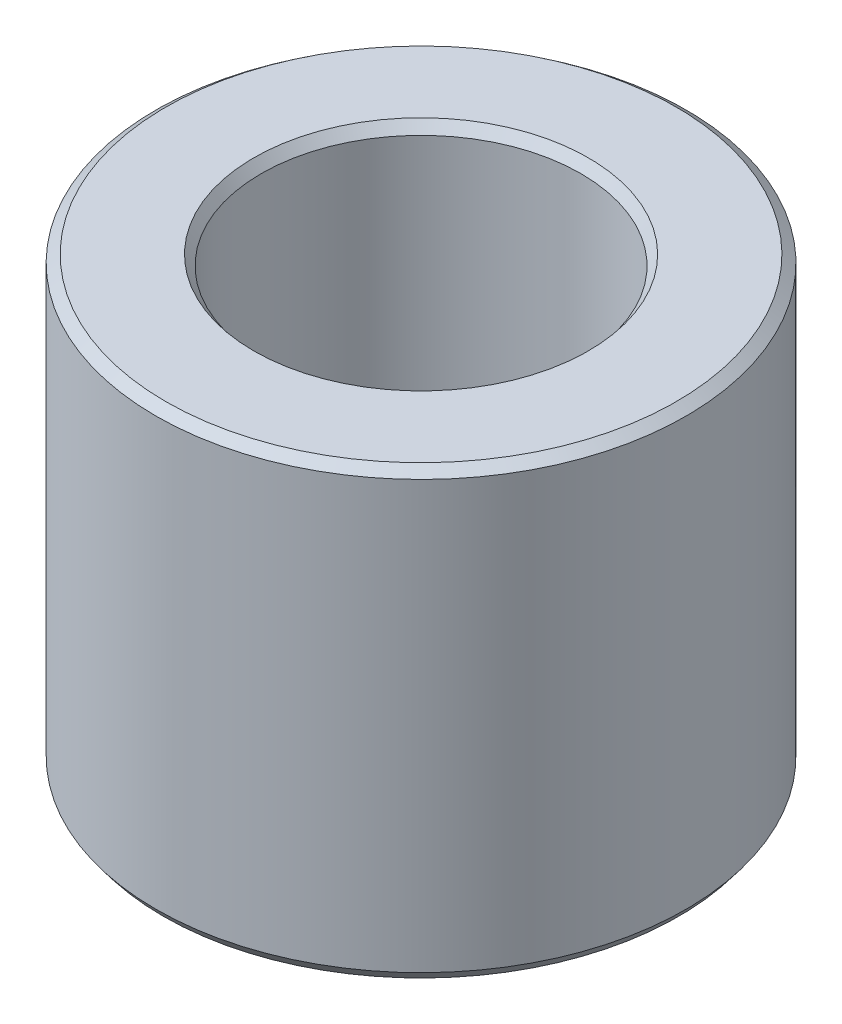
ISO-10303-21;
HEADER;
FILE_DESCRIPTION(('STEP AP214'),'2;1');
FILE_NAME('part.step','',(''),(''),'','','');
FILE_SCHEMA(('AUTOMOTIVE_DESIGN { 1 0 10303 214 1 1 1 1 }'));
ENDSEC;
DATA;
#1=APPLICATION_CONTEXT('core data for automotive mechanical design processes');
#2=APPLICATION_PROTOCOL_DEFINITION('international standard','automotive_design',2000,#1);
#3=PRODUCT_CONTEXT('',#1,'mechanical');
#4=PRODUCT('Part','Part','',(#3));
#5=PRODUCT_RELATED_PRODUCT_CATEGORY('part','',(#4));
#6=PRODUCT_DEFINITION_FORMATION('','',#4);
#7=PRODUCT_DEFINITION_CONTEXT('part definition',#1,'design');
#8=PRODUCT_DEFINITION('design','',#6,#7);
#9=PRODUCT_DEFINITION_SHAPE('','',#8);
#10=(LENGTH_UNIT() NAMED_UNIT(*) SI_UNIT(.MILLI.,.METRE.));
#11=(NAMED_UNIT(*) PLANE_ANGLE_UNIT() SI_UNIT($,.RADIAN.));
#12=(NAMED_UNIT(*) SI_UNIT($,.STERADIAN.) SOLID_ANGLE_UNIT());
#13=UNCERTAINTY_MEASURE_WITH_UNIT(LENGTH_MEASURE(1.E-05),#10,'distance_accuracy_value','');
#14=(GEOMETRIC_REPRESENTATION_CONTEXT(3) GLOBAL_UNCERTAINTY_ASSIGNED_CONTEXT((#13)) GLOBAL_UNIT_ASSIGNED_CONTEXT((#10,
#11,#12)) REPRESENTATION_CONTEXT('',''));
#15=CARTESIAN_POINT('',(0.,0.,0.));
#16=DIRECTION('',(0.,0.,1.));
#17=DIRECTION('',(1.,0.,0.));
#18=AXIS2_PLACEMENT_3D('',#15,#16,#17);
#19=CARTESIAN_POINT('',(0.,88.0326633458585,0.));
#20=DIRECTION('',(0.,-1.,0.));
#21=DIRECTION('',(0.,0.,-1.));
#22=AXIS2_PLACEMENT_3D('',#19,#20,#21);
#23=CYLINDRICAL_SURFACE('',#22,52.5);
#24=CARTESIAN_POINT('',(0.,1.9670224695832,0.));
#25=DIRECTION('',(0.,1.,0.));
#26=DIRECTION('',(0.,0.,1.));
#27=AXIS2_PLACEMENT_3D('',#24,#25,#26);
#28=CIRCLE('',#27,52.5);
#29=CARTESIAN_POINT('',(0.,1.9670224695832,52.5));
#30=VERTEX_POINT('',#29);
#31=EDGE_CURVE('E10',#30,#30,#28,.T.);
#32=ORIENTED_EDGE('',*,*,#31,.T.);
#33=EDGE_LOOP('',(#32));
#34=FACE_BOUND('',#33,.T.);
#35=CARTESIAN_POINT('',(0.,86.5494673652467,0.));
#36=DIRECTION('',(0.,1.,0.));
#37=DIRECTION('',(0.,0.,1.));
#38=AXIS2_PLACEMENT_3D('',#35,#36,#37);
#39=CIRCLE('',#38,52.5);
#40=CARTESIAN_POINT('',(0.,86.5494673652467,52.5));
#41=VERTEX_POINT('',#40);
#42=EDGE_CURVE('E50',#41,#41,#39,.F.);
#43=ORIENTED_EDGE('',*,*,#42,.T.);
#44=EDGE_LOOP('',(#43));
#45=FACE_BOUND('',#44,.T.);
#46=ADVANCED_FACE('F39',(#34,#45),#23,.T.);
#47=CARTESIAN_POINT('',(0.,88.0326633458585,0.));
#48=DIRECTION('',(0.,1.,0.));
#49=DIRECTION('',(0.,0.,1.));
#50=AXIS2_PLACEMENT_3D('',#47,#48,#49);
#51=PLANE('',#50);
#52=CARTESIAN_POINT('',(0.,88.0326633458585,0.));
#53=DIRECTION('',(0.,1.,0.));
#54=DIRECTION('',(0.,0.,1.));
#55=AXIS2_PLACEMENT_3D('',#52,#53,#54);
#56=CIRCLE('',#55,33.1297691724061);
#57=CARTESIAN_POINT('',(0.,88.0326633458585,33.1297691724061));
#58=VERTEX_POINT('',#57);
#59=EDGE_CURVE('E58',#58,#58,#56,.F.);
#60=ORIENTED_EDGE('',*,*,#59,.T.);
#61=EDGE_LOOP('',(#60));
#62=FACE_BOUND('',#61,.T.);
#63=CARTESIAN_POINT('',(0.,88.0326633458585,0.));
#64=DIRECTION('',(0.,1.,0.));
#65=DIRECTION('',(0.,0.,1.));
#66=AXIS2_PLACEMENT_3D('',#63,#64,#65);
#67=CIRCLE('',#66,50.5329775304167);
#68=CARTESIAN_POINT('',(0.,88.0326633458585,50.5329775304167));
#69=VERTEX_POINT('',#68);
#70=EDGE_CURVE('E61',#69,#69,#67,.T.);
#71=ORIENTED_EDGE('',*,*,#70,.T.);
#72=EDGE_LOOP('',(#71));
#73=FACE_BOUND('',#72,.T.);
#74=ADVANCED_FACE('F88',(#62,#73),#51,.T.);
#75=CARTESIAN_POINT('',(0.,0.,0.));
#76=DIRECTION('',(0.,1.,0.));
#77=DIRECTION('',(0.,0.,1.));
#78=AXIS2_PLACEMENT_3D('',#75,#76,#77);
#79=PLANE('',#78);
#80=CARTESIAN_POINT('',(0.,0.,0.));
#81=DIRECTION('',(0.,1.,0.));
#82=DIRECTION('',(0.,0.,1.));
#83=AXIS2_PLACEMENT_3D('',#80,#81,#82);
#84=CIRCLE('',#83,33.6135956613776);
#85=CARTESIAN_POINT('',(0.,0.,33.6135956613776));
#86=VERTEX_POINT('',#85);
#87=EDGE_CURVE('E51',#86,#86,#84,.T.);
#88=ORIENTED_EDGE('',*,*,#87,.T.);
#89=EDGE_LOOP('',(#88));
#90=FACE_BOUND('',#89,.T.);
#91=CARTESIAN_POINT('',(0.,0.,0.));
#92=DIRECTION('',(0.,1.,0.));
#93=DIRECTION('',(0.,0.,1.));
#94=AXIS2_PLACEMENT_3D('',#91,#92,#93);
#95=CIRCLE('',#94,51.0168040193883);
#96=CARTESIAN_POINT('',(0.,0.,51.0168040193883));
#97=VERTEX_POINT('',#96);
#98=EDGE_CURVE('E54',#97,#97,#95,.F.);
#99=ORIENTED_EDGE('',*,*,#98,.T.);
#100=EDGE_LOOP('',(#99));
#101=FACE_BOUND('',#100,.T.);
#102=ADVANCED_FACE('F83',(#90,#101),#79,.F.);
#103=CARTESIAN_POINT('',(0.,88.0326633458585,0.));
#104=DIRECTION('',(0.,-1.,0.));
#105=DIRECTION('',(0.,0.,-1.));
#106=AXIS2_PLACEMENT_3D('',#103,#104,#105);
#107=CYLINDRICAL_SURFACE('',#106,31.6465731917944);
#108=CARTESIAN_POINT('',(0.,86.0656408762752,0.));
#109=DIRECTION('',(0.,1.,0.));
#110=DIRECTION('',(0.,0.,1.));
#111=AXIS2_PLACEMENT_3D('',#108,#109,#110);
#112=CIRCLE('',#111,31.6465731917944);
#113=CARTESIAN_POINT('',(0.,86.0656408762752,31.6465731917944));
#114=VERTEX_POINT('',#113);
#115=EDGE_CURVE('E67',#114,#114,#112,.T.);
#116=ORIENTED_EDGE('',*,*,#115,.T.);
#117=EDGE_LOOP('',(#116));
#118=FACE_BOUND('',#117,.T.);
#119=CARTESIAN_POINT('',(0.,1.4831959806117,0.));
#120=DIRECTION('',(0.,1.,0.));
#121=DIRECTION('',(0.,0.,1.));
#122=AXIS2_PLACEMENT_3D('',#119,#120,#121);
#123=CIRCLE('',#122,31.6465731917944);
#124=CARTESIAN_POINT('',(0.,1.4831959806117,31.6465731917944));
#125=VERTEX_POINT('',#124);
#126=EDGE_CURVE('E69',#125,#125,#123,.F.);
#127=ORIENTED_EDGE('',*,*,#126,.T.);
#128=EDGE_LOOP('',(#127));
#129=FACE_BOUND('',#128,.T.);
#130=ADVANCED_FACE('F71',(#118,#129),#107,.F.);
#131=CARTESIAN_POINT('',(0.,86.0656408762752,0.));
#132=DIRECTION('',(0.,1.,0.));
#133=DIRECTION('',(0.,0.,1.));
#134=AXIS2_PLACEMENT_3D('',#131,#132,#133);
#135=CONICAL_SURFACE('',#134,31.6465731917944,0.646075980783514);
#136=ORIENTED_EDGE('',*,*,#59,.F.);
#137=EDGE_LOOP('',(#136));
#138=FACE_BOUND('',#137,.T.);
#139=ORIENTED_EDGE('',*,*,#115,.F.);
#140=EDGE_LOOP('',(#139));
#141=FACE_BOUND('',#140,.T.);
#142=ADVANCED_FACE('F77',(#138,#141),#135,.F.);
#143=CARTESIAN_POINT('',(0.,0.,0.));
#144=DIRECTION('',(0.,-1.,0.));
#145=DIRECTION('',(0.,0.,-1.));
#146=AXIS2_PLACEMENT_3D('',#143,#144,#145);
#147=CONICAL_SURFACE('',#146,33.6135956613776,0.924720346011378);
#148=ORIENTED_EDGE('',*,*,#126,.F.);
#149=EDGE_LOOP('',(#148));
#150=FACE_BOUND('',#149,.T.);
#151=ORIENTED_EDGE('',*,*,#87,.F.);
#152=EDGE_LOOP('',(#151));
#153=FACE_BOUND('',#152,.T.);
#154=ADVANCED_FACE('F73',(#150,#153),#147,.F.);
#155=CARTESIAN_POINT('',(0.,1.9670224695832,0.));
#156=DIRECTION('',(0.,1.,0.));
#157=DIRECTION('',(0.,0.,1.));
#158=AXIS2_PLACEMENT_3D('',#155,#156,#157);
#159=CONICAL_SURFACE('',#158,52.5,0.646075980783522);
#160=ORIENTED_EDGE('',*,*,#98,.F.);
#161=EDGE_LOOP('',(#160));
#162=FACE_BOUND('',#161,.T.);
#163=ORIENTED_EDGE('',*,*,#31,.F.);
#164=EDGE_LOOP('',(#163));
#165=FACE_BOUND('',#164,.T.);
#166=ADVANCED_FACE('F76',(#162,#165),#159,.T.);
#167=CARTESIAN_POINT('',(0.,88.0326633458585,0.));
#168=DIRECTION('',(0.,-1.,0.));
#169=DIRECTION('',(0.,0.,-1.));
#170=AXIS2_PLACEMENT_3D('',#167,#168,#169);
#171=CONICAL_SURFACE('',#170,50.5329775304167,0.924720346011378);
#172=ORIENTED_EDGE('',*,*,#42,.F.);
#173=EDGE_LOOP('',(#172));
#174=FACE_BOUND('',#173,.T.);
#175=ORIENTED_EDGE('',*,*,#70,.F.);
#176=EDGE_LOOP('',(#175));
#177=FACE_BOUND('',#176,.T.);
#178=ADVANCED_FACE('F45',(#174,#177),#171,.T.);
#179=CLOSED_SHELL('',(#46,#74,#102,#130,#142,#154,#166,#178));
#180=MANIFOLD_SOLID_BREP('B2',#179);
#181=ADVANCED_BREP_SHAPE_REPRESENTATION('',(#18,#180),#14);
#182=SHAPE_DEFINITION_REPRESENTATION(#9,#181);
ENDSEC;
END-ISO-10303-21;
